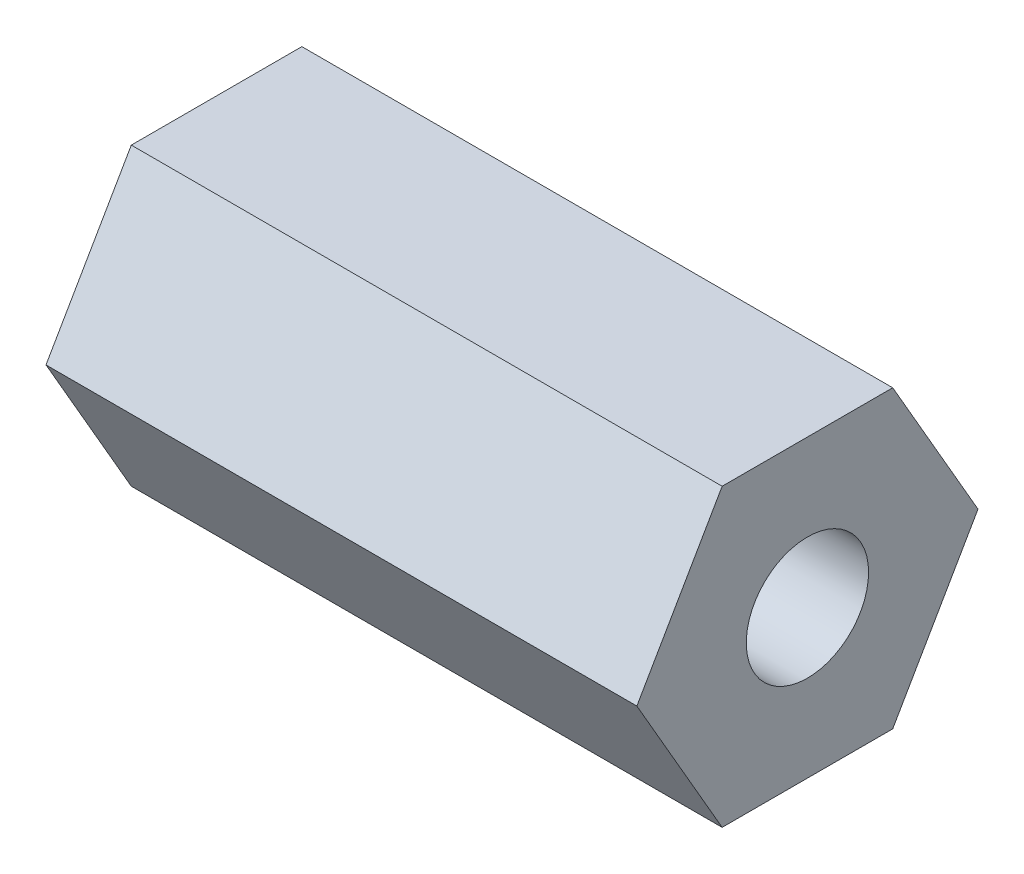
ISO-10303-21;
HEADER;
FILE_DESCRIPTION(('STEP AP214'),'2;1');
FILE_NAME('part.step','',(''),(''),'','','');
FILE_SCHEMA(('AUTOMOTIVE_DESIGN { 1 0 10303 214 1 1 1 1 }'));
ENDSEC;
DATA;
#1=APPLICATION_CONTEXT('core data for automotive mechanical design processes');
#2=APPLICATION_PROTOCOL_DEFINITION('international standard','automotive_design',2000,#1);
#3=PRODUCT_CONTEXT('',#1,'mechanical');
#4=PRODUCT('Part','Part','',(#3));
#5=PRODUCT_RELATED_PRODUCT_CATEGORY('part','',(#4));
#6=PRODUCT_DEFINITION_FORMATION('','',#4);
#7=PRODUCT_DEFINITION_CONTEXT('part definition',#1,'design');
#8=PRODUCT_DEFINITION('design','',#6,#7);
#9=PRODUCT_DEFINITION_SHAPE('','',#8);
#10=(LENGTH_UNIT() NAMED_UNIT(*) SI_UNIT(.MILLI.,.METRE.));
#11=(NAMED_UNIT(*) PLANE_ANGLE_UNIT() SI_UNIT($,.RADIAN.));
#12=(NAMED_UNIT(*) SI_UNIT($,.STERADIAN.) SOLID_ANGLE_UNIT());
#13=UNCERTAINTY_MEASURE_WITH_UNIT(LENGTH_MEASURE(1.E-05),#10,'distance_accuracy_value','');
#14=(GEOMETRIC_REPRESENTATION_CONTEXT(3) GLOBAL_UNCERTAINTY_ASSIGNED_CONTEXT((#13)) GLOBAL_UNIT_ASSIGNED_CONTEXT((#10,
#11,#12)) REPRESENTATION_CONTEXT('',''));
#15=CARTESIAN_POINT('',(0.,0.,0.));
#16=DIRECTION('',(0.,0.,1.));
#17=DIRECTION('',(1.,0.,0.));
#18=AXIS2_PLACEMENT_3D('',#15,#16,#17);
#19=CARTESIAN_POINT('',(25.4,0.,0.));
#20=DIRECTION('',(1.,0.,0.));
#21=DIRECTION('',(0.,0.,-1.));
#22=AXIS2_PLACEMENT_3D('',#19,#20,#21);
#23=PLANE('',#22);
#24=DIRECTION('',(0.,0.,-1.));
#25=VECTOR('',#24,1.);
#26=CARTESIAN_POINT('',(25.4,-6.35,3.66617420935412));
#27=LINE('',#26,#25);
#28=CARTESIAN_POINT('',(25.4,-6.35,3.66617420935412));
#29=VERTEX_POINT('',#28);
#30=CARTESIAN_POINT('',(25.4,-6.35,-3.66617420935412));
#31=VERTEX_POINT('',#30);
#32=EDGE_CURVE('E132',#29,#31,#27,.T.);
#33=ORIENTED_EDGE('',*,*,#32,.T.);
#34=DIRECTION('',(0.,0.866025403784439,-0.5));
#35=VECTOR('',#34,1.);
#36=CARTESIAN_POINT('',(25.4,-6.35,-3.66617420935412));
#37=LINE('',#36,#35);
#38=CARTESIAN_POINT('',(25.4,0.,-7.33234841870825));
#39=VERTEX_POINT('',#38);
#40=EDGE_CURVE('E90',#31,#39,#37,.T.);
#41=ORIENTED_EDGE('',*,*,#40,.T.);
#42=DIRECTION('',(0.,0.866025403784439,0.5));
#43=VECTOR('',#42,1.);
#44=CARTESIAN_POINT('',(25.4,0.,-7.33234841870825));
#45=LINE('',#44,#43);
#46=CARTESIAN_POINT('',(25.4,6.35,-3.66617420935412));
#47=VERTEX_POINT('',#46);
#48=EDGE_CURVE('E103',#39,#47,#45,.T.);
#49=ORIENTED_EDGE('',*,*,#48,.T.);
#50=DIRECTION('',(0.,0.,1.));
#51=VECTOR('',#50,1.);
#52=CARTESIAN_POINT('',(25.4,6.35,-3.66617420935412));
#53=LINE('',#52,#51);
#54=CARTESIAN_POINT('',(25.4,6.35,3.66617420935412));
#55=VERTEX_POINT('',#54);
#56=EDGE_CURVE('E97',#47,#55,#53,.T.);
#57=ORIENTED_EDGE('',*,*,#56,.T.);
#58=DIRECTION('',(0.,-0.866025403784439,0.5));
#59=VECTOR('',#58,1.);
#60=CARTESIAN_POINT('',(25.4,6.35,3.66617420935412));
#61=LINE('',#60,#59);
#62=CARTESIAN_POINT('',(25.4,0.,7.33234841870824));
#63=VERTEX_POINT('',#62);
#64=EDGE_CURVE('E101',#55,#63,#61,.T.);
#65=ORIENTED_EDGE('',*,*,#64,.T.);
#66=DIRECTION('',(0.,-0.866025403784439,-0.5));
#67=VECTOR('',#66,1.);
#68=CARTESIAN_POINT('',(25.4,0.,7.33234841870824));
#69=LINE('',#68,#67);
#70=EDGE_CURVE('E53',#63,#29,#69,.T.);
#71=ORIENTED_EDGE('',*,*,#70,.T.);
#72=EDGE_LOOP('',(#33,#41,#49,#57,#65,#71));
#73=FACE_BOUND('',#72,.T.);
#74=CARTESIAN_POINT('',(25.4,0.,0.));
#75=DIRECTION('',(1.,0.,0.));
#76=DIRECTION('',(0.,0.,-1.));
#77=AXIS2_PLACEMENT_3D('',#74,#75,#76);
#78=CIRCLE('',#77,2.6289);
#79=CARTESIAN_POINT('',(25.4,0.,-2.6289));
#80=VERTEX_POINT('',#79);
#81=EDGE_CURVE('E125',#80,#80,#78,.T.);
#82=ORIENTED_EDGE('',*,*,#81,.F.);
#83=EDGE_LOOP('',(#82));
#84=FACE_BOUND('',#83,.T.);
#85=ADVANCED_FACE('F36',(#73,#84),#23,.T.);
#86=CARTESIAN_POINT('',(0.,0.,0.));
#87=DIRECTION('',(1.,0.,0.));
#88=DIRECTION('',(0.,0.,-1.));
#89=AXIS2_PLACEMENT_3D('',#86,#87,#88);
#90=PLANE('',#89);
#91=DIRECTION('',(0.,0.,-1.));
#92=VECTOR('',#91,1.);
#93=CARTESIAN_POINT('',(0.,-6.35,3.66617420935412));
#94=LINE('',#93,#92);
#95=CARTESIAN_POINT('',(0.,-6.35,3.66617420935412));
#96=VERTEX_POINT('',#95);
#97=CARTESIAN_POINT('',(0.,-6.35,-3.66617420935412));
#98=VERTEX_POINT('',#97);
#99=EDGE_CURVE('E121',#96,#98,#94,.T.);
#100=ORIENTED_EDGE('',*,*,#99,.F.);
#101=DIRECTION('',(0.,-0.866025403784439,-0.5));
#102=VECTOR('',#101,1.);
#103=CARTESIAN_POINT('',(0.,0.,7.33234841870824));
#104=LINE('',#103,#102);
#105=CARTESIAN_POINT('',(0.,0.,7.33234841870824));
#106=VERTEX_POINT('',#105);
#107=EDGE_CURVE('E82',#106,#96,#104,.T.);
#108=ORIENTED_EDGE('',*,*,#107,.F.);
#109=DIRECTION('',(0.,-0.866025403784439,0.5));
#110=VECTOR('',#109,1.);
#111=CARTESIAN_POINT('',(0.,6.35,3.66617420935412));
#112=LINE('',#111,#110);
#113=CARTESIAN_POINT('',(0.,6.35,3.66617420935412));
#114=VERTEX_POINT('',#113);
#115=EDGE_CURVE('E76',#114,#106,#112,.T.);
#116=ORIENTED_EDGE('',*,*,#115,.F.);
#117=DIRECTION('',(0.,0.,1.));
#118=VECTOR('',#117,1.);
#119=CARTESIAN_POINT('',(0.,6.35,-3.66617420935412));
#120=LINE('',#119,#118);
#121=CARTESIAN_POINT('',(0.,6.35,-3.66617420935412));
#122=VERTEX_POINT('',#121);
#123=EDGE_CURVE('E111',#122,#114,#120,.T.);
#124=ORIENTED_EDGE('',*,*,#123,.F.);
#125=DIRECTION('',(0.,0.866025403784439,0.5));
#126=VECTOR('',#125,1.);
#127=CARTESIAN_POINT('',(0.,0.,-7.33234841870825));
#128=LINE('',#127,#126);
#129=CARTESIAN_POINT('',(0.,0.,-7.33234841870825));
#130=VERTEX_POINT('',#129);
#131=EDGE_CURVE('E127',#130,#122,#128,.T.);
#132=ORIENTED_EDGE('',*,*,#131,.F.);
#133=DIRECTION('',(0.,0.866025403784439,-0.5));
#134=VECTOR('',#133,1.);
#135=CARTESIAN_POINT('',(0.,-6.35,-3.66617420935412));
#136=LINE('',#135,#134);
#137=EDGE_CURVE('E124',#98,#130,#136,.T.);
#138=ORIENTED_EDGE('',*,*,#137,.F.);
#139=EDGE_LOOP('',(#100,#108,#116,#124,#132,#138));
#140=FACE_BOUND('',#139,.T.);
#141=CARTESIAN_POINT('',(0.,0.,0.));
#142=DIRECTION('',(1.,0.,0.));
#143=DIRECTION('',(0.,0.,-1.));
#144=AXIS2_PLACEMENT_3D('',#141,#142,#143);
#145=CIRCLE('',#144,2.6289);
#146=CARTESIAN_POINT('',(0.,0.,-2.6289));
#147=VERTEX_POINT('',#146);
#148=EDGE_CURVE('E225',#147,#147,#145,.T.);
#149=ORIENTED_EDGE('',*,*,#148,.T.);
#150=EDGE_LOOP('',(#149));
#151=FACE_BOUND('',#150,.T.);
#152=ADVANCED_FACE('F141',(#140,#151),#90,.F.);
#153=CARTESIAN_POINT('',(25.4,-6.35,3.66617420935412));
#154=DIRECTION('',(0.,1.,0.));
#155=DIRECTION('',(0.,0.,1.));
#156=AXIS2_PLACEMENT_3D('',#153,#154,#155);
#157=PLANE('',#156);
#158=ORIENTED_EDGE('',*,*,#99,.T.);
#159=DIRECTION('',(-1.,0.,0.));
#160=VECTOR('',#159,1.);
#161=CARTESIAN_POINT('',(25.4,-6.35,-3.66617420935412));
#162=LINE('',#161,#160);
#163=EDGE_CURVE('E11',#31,#98,#162,.T.);
#164=ORIENTED_EDGE('',*,*,#163,.F.);
#165=ORIENTED_EDGE('',*,*,#32,.F.);
#166=DIRECTION('',(-1.,0.,0.));
#167=VECTOR('',#166,1.);
#168=CARTESIAN_POINT('',(25.4,-6.35,3.66617420935412));
#169=LINE('',#168,#167);
#170=EDGE_CURVE('E117',#29,#96,#169,.T.);
#171=ORIENTED_EDGE('',*,*,#170,.T.);
#172=EDGE_LOOP('',(#158,#164,#165,#171));
#173=FACE_BOUND('',#172,.T.);
#174=ADVANCED_FACE('F38',(#173),#157,.F.);
#175=CARTESIAN_POINT('',(25.4,-6.35,-3.66617420935412));
#176=DIRECTION('',(0.,0.5,0.866025403784438));
#177=DIRECTION('',(0.,-0.866025403784439,0.5));
#178=AXIS2_PLACEMENT_3D('',#175,#176,#177);
#179=PLANE('',#178);
#180=ORIENTED_EDGE('',*,*,#137,.T.);
#181=DIRECTION('',(-1.,0.,0.));
#182=VECTOR('',#181,1.);
#183=CARTESIAN_POINT('',(25.4,0.,-7.33234841870825));
#184=LINE('',#183,#182);
#185=EDGE_CURVE('E45',#39,#130,#184,.T.);
#186=ORIENTED_EDGE('',*,*,#185,.F.);
#187=ORIENTED_EDGE('',*,*,#40,.F.);
#188=ORIENTED_EDGE('',*,*,#163,.T.);
#189=EDGE_LOOP('',(#180,#186,#187,#188));
#190=FACE_BOUND('',#189,.T.);
#191=ADVANCED_FACE('F166',(#190),#179,.F.);
#192=CARTESIAN_POINT('',(25.4,0.,-7.33234841870825));
#193=DIRECTION('',(0.,-0.5,0.866025403784439));
#194=DIRECTION('',(0.,-0.866025403784439,-0.5));
#195=AXIS2_PLACEMENT_3D('',#192,#193,#194);
#196=PLANE('',#195);
#197=ORIENTED_EDGE('',*,*,#131,.T.);
#198=DIRECTION('',(-1.,0.,0.));
#199=VECTOR('',#198,1.);
#200=CARTESIAN_POINT('',(25.4,6.35,-3.66617420935412));
#201=LINE('',#200,#199);
#202=EDGE_CURVE('E112',#47,#122,#201,.T.);
#203=ORIENTED_EDGE('',*,*,#202,.F.);
#204=ORIENTED_EDGE('',*,*,#48,.F.);
#205=ORIENTED_EDGE('',*,*,#185,.T.);
#206=EDGE_LOOP('',(#197,#203,#204,#205));
#207=FACE_BOUND('',#206,.T.);
#208=ADVANCED_FACE('F138',(#207),#196,.F.);
#209=CARTESIAN_POINT('',(25.4,6.35,-3.66617420935412));
#210=DIRECTION('',(0.,-1.,0.));
#211=DIRECTION('',(0.,0.,-1.));
#212=AXIS2_PLACEMENT_3D('',#209,#210,#211);
#213=PLANE('',#212);
#214=ORIENTED_EDGE('',*,*,#123,.T.);
#215=DIRECTION('',(-1.,0.,0.));
#216=VECTOR('',#215,1.);
#217=CARTESIAN_POINT('',(25.4,6.35,3.66617420935412));
#218=LINE('',#217,#216);
#219=EDGE_CURVE('E108',#55,#114,#218,.T.);
#220=ORIENTED_EDGE('',*,*,#219,.F.);
#221=ORIENTED_EDGE('',*,*,#56,.F.);
#222=ORIENTED_EDGE('',*,*,#202,.T.);
#223=EDGE_LOOP('',(#214,#220,#221,#222));
#224=FACE_BOUND('',#223,.T.);
#225=ADVANCED_FACE('F109',(#224),#213,.F.);
#226=CARTESIAN_POINT('',(25.4,6.35,3.66617420935412));
#227=DIRECTION('',(0.,-0.5,-0.866025403784439));
#228=DIRECTION('',(0.,0.866025403784439,-0.5));
#229=AXIS2_PLACEMENT_3D('',#226,#227,#228);
#230=PLANE('',#229);
#231=ORIENTED_EDGE('',*,*,#115,.T.);
#232=DIRECTION('',(-1.,0.,0.));
#233=VECTOR('',#232,1.);
#234=CARTESIAN_POINT('',(25.4,0.,7.33234841870824));
#235=LINE('',#234,#233);
#236=EDGE_CURVE('E113',#63,#106,#235,.T.);
#237=ORIENTED_EDGE('',*,*,#236,.F.);
#238=ORIENTED_EDGE('',*,*,#64,.F.);
#239=ORIENTED_EDGE('',*,*,#219,.T.);
#240=EDGE_LOOP('',(#231,#237,#238,#239));
#241=FACE_BOUND('',#240,.T.);
#242=ADVANCED_FACE('F115',(#241),#230,.F.);
#243=CARTESIAN_POINT('',(25.4,0.,7.33234841870824));
#244=DIRECTION('',(0.,0.5,-0.866025403784439));
#245=DIRECTION('',(0.,0.866025403784439,0.5));
#246=AXIS2_PLACEMENT_3D('',#243,#244,#245);
#247=PLANE('',#246);
#248=ORIENTED_EDGE('',*,*,#107,.T.);
#249=ORIENTED_EDGE('',*,*,#170,.F.);
#250=ORIENTED_EDGE('',*,*,#70,.F.);
#251=ORIENTED_EDGE('',*,*,#236,.T.);
#252=EDGE_LOOP('',(#248,#249,#250,#251));
#253=FACE_BOUND('',#252,.T.);
#254=ADVANCED_FACE('F146',(#253),#247,.F.);
#255=CARTESIAN_POINT('',(25.4,0.,0.));
#256=DIRECTION('',(-1.,0.,0.));
#257=DIRECTION('',(0.,0.,1.));
#258=AXIS2_PLACEMENT_3D('',#255,#256,#257);
#259=CYLINDRICAL_SURFACE('',#258,2.6289);
#260=ORIENTED_EDGE('',*,*,#81,.T.);
#261=EDGE_LOOP('',(#260));
#262=FACE_BOUND('',#261,.T.);
#263=ORIENTED_EDGE('',*,*,#148,.F.);
#264=EDGE_LOOP('',(#263));
#265=FACE_BOUND('',#264,.T.);
#266=ADVANCED_FACE('F148',(#262,#265),#259,.F.);
#267=CLOSED_SHELL('',(#85,#152,#174,#191,#208,#225,#242,#254,#266));
#268=MANIFOLD_SOLID_BREP('B2',#267);
#269=ADVANCED_BREP_SHAPE_REPRESENTATION('',(#18,#268),#14);
#270=SHAPE_DEFINITION_REPRESENTATION(#9,#269);
ENDSEC;
END-ISO-10303-21;
